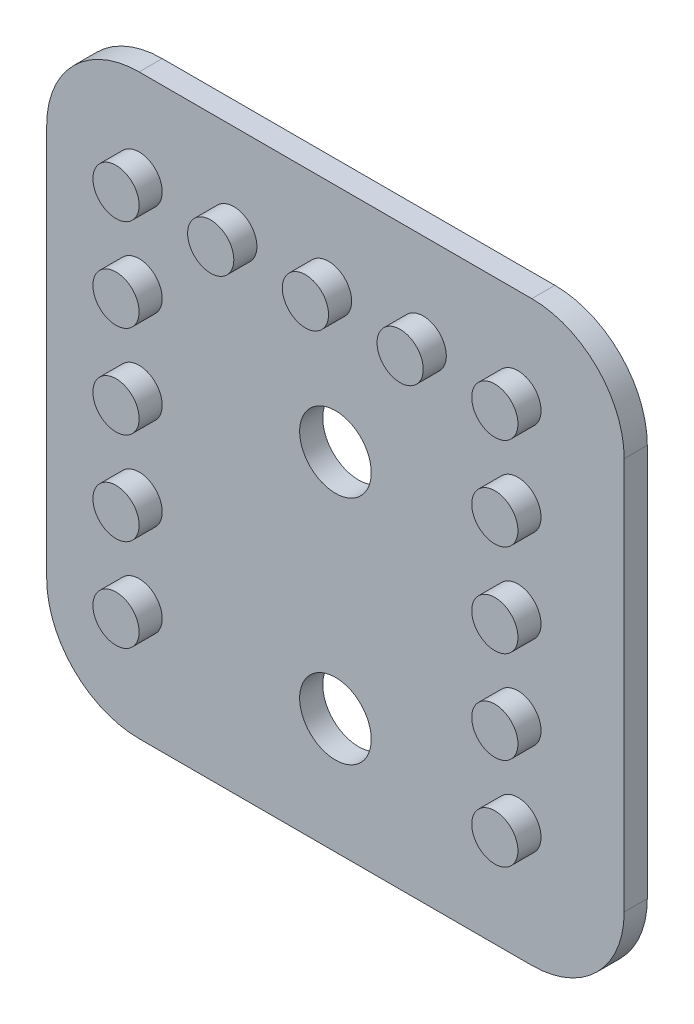
ISO-10303-21;
HEADER;
FILE_DESCRIPTION(('STEP AP214'),'2;1');
FILE_NAME('part.step','',(''),(''),'','','');
FILE_SCHEMA(('AUTOMOTIVE_DESIGN { 1 0 10303 214 1 1 1 1 }'));
ENDSEC;
DATA;
#1=APPLICATION_CONTEXT('core data for automotive mechanical design processes');
#2=APPLICATION_PROTOCOL_DEFINITION('international standard','automotive_design',2000,#1);
#3=PRODUCT_CONTEXT('',#1,'mechanical');
#4=PRODUCT('Part','Part','',(#3));
#5=PRODUCT_RELATED_PRODUCT_CATEGORY('part','',(#4));
#6=PRODUCT_DEFINITION_FORMATION('','',#4);
#7=PRODUCT_DEFINITION_CONTEXT('part definition',#1,'design');
#8=PRODUCT_DEFINITION('design','',#6,#7);
#9=PRODUCT_DEFINITION_SHAPE('','',#8);
#10=(LENGTH_UNIT() NAMED_UNIT(*) SI_UNIT(.MILLI.,.METRE.));
#11=(NAMED_UNIT(*) PLANE_ANGLE_UNIT() SI_UNIT($,.RADIAN.));
#12=(NAMED_UNIT(*) SI_UNIT($,.STERADIAN.) SOLID_ANGLE_UNIT());
#13=UNCERTAINTY_MEASURE_WITH_UNIT(LENGTH_MEASURE(1.E-05),#10,'distance_accuracy_value','');
#14=(GEOMETRIC_REPRESENTATION_CONTEXT(3) GLOBAL_UNCERTAINTY_ASSIGNED_CONTEXT((#13)) GLOBAL_UNIT_ASSIGNED_CONTEXT((#10,
#11,#12)) REPRESENTATION_CONTEXT('',''));
#15=CARTESIAN_POINT('',(0.,0.,0.));
#16=DIRECTION('',(0.,0.,1.));
#17=DIRECTION('',(1.,0.,0.));
#18=AXIS2_PLACEMENT_3D('',#15,#16,#17);
#19=CARTESIAN_POINT('',(0.,0.,1.));
#20=DIRECTION('',(0.,0.,1.));
#21=DIRECTION('',(1.,0.,0.));
#22=AXIS2_PLACEMENT_3D('',#19,#20,#21);
#23=PLANE('',#22);
#24=CARTESIAN_POINT('',(-23.5,13.,1.));
#25=DIRECTION('',(0.,0.,1.));
#26=DIRECTION('',(1.,0.,0.));
#27=AXIS2_PLACEMENT_3D('',#24,#25,#26);
#28=CIRCLE('',#27,1.55);
#29=CARTESIAN_POINT('',(-21.95,13.,1.));
#30=VERTEX_POINT('',#29);
#31=EDGE_CURVE('E256',#30,#30,#28,.T.);
#32=ORIENTED_EDGE('',*,*,#31,.F.);
#33=EDGE_LOOP('',(#32));
#34=FACE_BOUND('',#33,.T.);
#35=CARTESIAN_POINT('',(-23.5,23.,1.));
#36=DIRECTION('',(0.,0.,1.));
#37=DIRECTION('',(1.,0.,0.));
#38=AXIS2_PLACEMENT_3D('',#35,#36,#37);
#39=CIRCLE('',#38,1.55);
#40=CARTESIAN_POINT('',(-21.95,23.,1.));
#41=VERTEX_POINT('',#40);
#42=EDGE_CURVE('E250',#41,#41,#39,.T.);
#43=ORIENTED_EDGE('',*,*,#42,.F.);
#44=EDGE_LOOP('',(#43));
#45=FACE_BOUND('',#44,.T.);
#46=CARTESIAN_POINT('',(-31.9999999999998,13.,1.));
#47=DIRECTION('',(0.,0.,1.));
#48=DIRECTION('',(1.,0.,0.));
#49=AXIS2_PLACEMENT_3D('',#46,#47,#48);
#50=CIRCLE('',#49,0.999999999999998);
#51=CARTESIAN_POINT('',(-30.9999999999998,13.,1.));
#52=VERTEX_POINT('',#51);
#53=EDGE_CURVE('E236',#52,#52,#50,.T.);
#54=ORIENTED_EDGE('',*,*,#53,.F.);
#55=EDGE_LOOP('',(#54));
#56=FACE_BOUND('',#55,.T.);
#57=CARTESIAN_POINT('',(-31.9999999999999,17.,1.));
#58=DIRECTION('',(0.,0.,1.));
#59=DIRECTION('',(1.,0.,0.));
#60=AXIS2_PLACEMENT_3D('',#57,#58,#59);
#61=CIRCLE('',#60,0.999999999999998);
#62=CARTESIAN_POINT('',(-30.9999999999999,17.,1.));
#63=VERTEX_POINT('',#62);
#64=EDGE_CURVE('E224',#63,#63,#61,.T.);
#65=ORIENTED_EDGE('',*,*,#64,.F.);
#66=EDGE_LOOP('',(#65));
#67=FACE_BOUND('',#66,.T.);
#68=CARTESIAN_POINT('',(-31.9999999999999,21.,1.));
#69=DIRECTION('',(0.,0.,1.));
#70=DIRECTION('',(1.,0.,0.));
#71=AXIS2_PLACEMENT_3D('',#68,#69,#70);
#72=CIRCLE('',#71,0.999999999999998);
#73=CARTESIAN_POINT('',(-30.9999999999999,21.,1.));
#74=VERTEX_POINT('',#73);
#75=EDGE_CURVE('E212',#74,#74,#72,.T.);
#76=ORIENTED_EDGE('',*,*,#75,.F.);
#77=EDGE_LOOP('',(#76));
#78=FACE_BOUND('',#77,.T.);
#79=CARTESIAN_POINT('',(-32.,25.,1.));
#80=DIRECTION('',(0.,0.,1.));
#81=DIRECTION('',(1.,0.,0.));
#82=AXIS2_PLACEMENT_3D('',#79,#80,#81);
#83=CIRCLE('',#82,0.999999999999998);
#84=CARTESIAN_POINT('',(-31.,25.,1.));
#85=VERTEX_POINT('',#84);
#86=EDGE_CURVE('E200',#85,#85,#83,.T.);
#87=ORIENTED_EDGE('',*,*,#86,.F.);
#88=EDGE_LOOP('',(#87));
#89=FACE_BOUND('',#88,.T.);
#90=CARTESIAN_POINT('',(-19.7,29.,1.));
#91=DIRECTION('',(0.,0.,1.));
#92=DIRECTION('',(1.,0.,0.));
#93=AXIS2_PLACEMENT_3D('',#90,#91,#92);
#94=CIRCLE('',#93,0.999999999999998);
#95=CARTESIAN_POINT('',(-18.7,29.,1.));
#96=VERTEX_POINT('',#95);
#97=EDGE_CURVE('E188',#96,#96,#94,.T.);
#98=ORIENTED_EDGE('',*,*,#97,.F.);
#99=EDGE_LOOP('',(#98));
#100=FACE_BOUND('',#99,.T.);
#101=CARTESIAN_POINT('',(-27.9,29.,1.));
#102=DIRECTION('',(0.,0.,1.));
#103=DIRECTION('',(1.,0.,0.));
#104=AXIS2_PLACEMENT_3D('',#101,#102,#103);
#105=CIRCLE('',#104,0.999999999999998);
#106=CARTESIAN_POINT('',(-26.9,29.,1.));
#107=VERTEX_POINT('',#106);
#108=EDGE_CURVE('E176',#107,#107,#105,.T.);
#109=ORIENTED_EDGE('',*,*,#108,.F.);
#110=EDGE_LOOP('',(#109));
#111=FACE_BOUND('',#110,.T.);
#112=DIRECTION('',(0.,-1.,0.));
#113=VECTOR('',#112,1.);
#114=CARTESIAN_POINT('',(-36.,8.,1.));
#115=LINE('',#114,#113);
#116=CARTESIAN_POINT('',(-36.,29.,1.));
#117=VERTEX_POINT('',#116);
#118=CARTESIAN_POINT('',(-36.,12.,1.));
#119=VERTEX_POINT('',#118);
#120=EDGE_CURVE('E169',#117,#119,#115,.T.);
#121=ORIENTED_EDGE('',*,*,#120,.T.);
#122=CARTESIAN_POINT('',(-32.,12.,1.));
#123=DIRECTION('',(0.,0.,1.));
#124=DIRECTION('',(1.,0.,0.));
#125=AXIS2_PLACEMENT_3D('',#122,#123,#124);
#126=CIRCLE('',#125,4.);
#127=CARTESIAN_POINT('',(-32.,8.,1.));
#128=VERTEX_POINT('',#127);
#129=EDGE_CURVE('E146',#119,#128,#126,.T.);
#130=ORIENTED_EDGE('',*,*,#129,.T.);
#131=DIRECTION('',(1.,0.,0.));
#132=VECTOR('',#131,1.);
#133=CARTESIAN_POINT('',(-11.,8.00000000000001,1.));
#134=LINE('',#133,#132);
#135=CARTESIAN_POINT('',(-15.,8.00000000000001,1.));
#136=VERTEX_POINT('',#135);
#137=EDGE_CURVE('E118',#128,#136,#134,.T.);
#138=ORIENTED_EDGE('',*,*,#137,.T.);
#139=CARTESIAN_POINT('',(-15.,12.,1.));
#140=DIRECTION('',(0.,0.,1.));
#141=DIRECTION('',(1.,0.,0.));
#142=AXIS2_PLACEMENT_3D('',#139,#140,#141);
#143=CIRCLE('',#142,4.);
#144=CARTESIAN_POINT('',(-11.,12.,1.));
#145=VERTEX_POINT('',#144);
#146=EDGE_CURVE('E144',#136,#145,#143,.T.);
#147=ORIENTED_EDGE('',*,*,#146,.T.);
#148=DIRECTION('',(0.,1.,0.));
#149=VECTOR('',#148,1.);
#150=CARTESIAN_POINT('',(-11.,8.00000000000001,1.));
#151=LINE('',#150,#149);
#152=CARTESIAN_POINT('',(-11.,29.,1.));
#153=VERTEX_POINT('',#152);
#154=EDGE_CURVE('E124',#145,#153,#151,.T.);
#155=ORIENTED_EDGE('',*,*,#154,.T.);
#156=CARTESIAN_POINT('',(-15.,29.,1.));
#157=DIRECTION('',(0.,0.,1.));
#158=DIRECTION('',(1.,0.,0.));
#159=AXIS2_PLACEMENT_3D('',#156,#157,#158);
#160=CIRCLE('',#159,4.);
#161=CARTESIAN_POINT('',(-15.,33.,1.));
#162=VERTEX_POINT('',#161);
#163=EDGE_CURVE('E53',#153,#162,#160,.T.);
#164=ORIENTED_EDGE('',*,*,#163,.T.);
#165=DIRECTION('',(-1.,0.,0.));
#166=VECTOR('',#165,1.);
#167=CARTESIAN_POINT('',(-11.,33.,1.));
#168=LINE('',#167,#166);
#169=CARTESIAN_POINT('',(-32.,33.,1.));
#170=VERTEX_POINT('',#169);
#171=EDGE_CURVE('E127',#162,#170,#168,.T.);
#172=ORIENTED_EDGE('',*,*,#171,.T.);
#173=CARTESIAN_POINT('',(-32.,29.,1.));
#174=DIRECTION('',(0.,0.,1.));
#175=DIRECTION('',(1.,0.,0.));
#176=AXIS2_PLACEMENT_3D('',#173,#174,#175);
#177=CIRCLE('',#176,4.);
#178=EDGE_CURVE('E141',#170,#117,#177,.T.);
#179=ORIENTED_EDGE('',*,*,#178,.T.);
#180=EDGE_LOOP('',(#121,#130,#138,#147,#155,#164,#172,#179));
#181=FACE_BOUND('',#180,.T.);
#182=CARTESIAN_POINT('',(-32.,29.,1.));
#183=DIRECTION('',(0.,0.,1.));
#184=DIRECTION('',(1.,0.,0.));
#185=AXIS2_PLACEMENT_3D('',#182,#183,#184);
#186=CIRCLE('',#185,0.999999999999998);
#187=CARTESIAN_POINT('',(-31.,29.,1.));
#188=VERTEX_POINT('',#187);
#189=EDGE_CURVE('E165',#188,#188,#186,.T.);
#190=ORIENTED_EDGE('',*,*,#189,.F.);
#191=EDGE_LOOP('',(#190));
#192=FACE_BOUND('',#191,.T.);
#193=CARTESIAN_POINT('',(-23.8,29.,1.));
#194=DIRECTION('',(0.,0.,1.));
#195=DIRECTION('',(1.,0.,0.));
#196=AXIS2_PLACEMENT_3D('',#193,#194,#195);
#197=CIRCLE('',#196,0.999999999999998);
#198=CARTESIAN_POINT('',(-22.8,29.,1.));
#199=VERTEX_POINT('',#198);
#200=EDGE_CURVE('E182',#199,#199,#197,.T.);
#201=ORIENTED_EDGE('',*,*,#200,.F.);
#202=EDGE_LOOP('',(#201));
#203=FACE_BOUND('',#202,.T.);
#204=CARTESIAN_POINT('',(-15.6,29.,1.));
#205=DIRECTION('',(0.,0.,1.));
#206=DIRECTION('',(1.,0.,0.));
#207=AXIS2_PLACEMENT_3D('',#204,#205,#206);
#208=CIRCLE('',#207,0.999999999999998);
#209=CARTESIAN_POINT('',(-14.6,29.,1.));
#210=VERTEX_POINT('',#209);
#211=EDGE_CURVE('E194',#210,#210,#208,.T.);
#212=ORIENTED_EDGE('',*,*,#211,.F.);
#213=EDGE_LOOP('',(#212));
#214=FACE_BOUND('',#213,.T.);
#215=CARTESIAN_POINT('',(-15.6,25.,1.));
#216=DIRECTION('',(0.,0.,1.));
#217=DIRECTION('',(1.,0.,0.));
#218=AXIS2_PLACEMENT_3D('',#215,#216,#217);
#219=CIRCLE('',#218,0.999999999999998);
#220=CARTESIAN_POINT('',(-14.6,25.,1.));
#221=VERTEX_POINT('',#220);
#222=EDGE_CURVE('E206',#221,#221,#219,.T.);
#223=ORIENTED_EDGE('',*,*,#222,.F.);
#224=EDGE_LOOP('',(#223));
#225=FACE_BOUND('',#224,.T.);
#226=CARTESIAN_POINT('',(-15.5999999999999,21.,1.));
#227=DIRECTION('',(0.,0.,1.));
#228=DIRECTION('',(1.,0.,0.));
#229=AXIS2_PLACEMENT_3D('',#226,#227,#228);
#230=CIRCLE('',#229,0.999999999999998);
#231=CARTESIAN_POINT('',(-14.5999999999999,21.,1.));
#232=VERTEX_POINT('',#231);
#233=EDGE_CURVE('E218',#232,#232,#230,.T.);
#234=ORIENTED_EDGE('',*,*,#233,.F.);
#235=EDGE_LOOP('',(#234));
#236=FACE_BOUND('',#235,.T.);
#237=CARTESIAN_POINT('',(-15.5999999999999,17.,1.));
#238=DIRECTION('',(0.,0.,1.));
#239=DIRECTION('',(1.,0.,0.));
#240=AXIS2_PLACEMENT_3D('',#237,#238,#239);
#241=CIRCLE('',#240,0.999999999999998);
#242=CARTESIAN_POINT('',(-14.5999999999999,17.,1.));
#243=VERTEX_POINT('',#242);
#244=EDGE_CURVE('E230',#243,#243,#241,.T.);
#245=ORIENTED_EDGE('',*,*,#244,.F.);
#246=EDGE_LOOP('',(#245));
#247=FACE_BOUND('',#246,.T.);
#248=CARTESIAN_POINT('',(-15.5999999999998,13.,1.));
#249=DIRECTION('',(0.,0.,1.));
#250=DIRECTION('',(1.,0.,0.));
#251=AXIS2_PLACEMENT_3D('',#248,#249,#250);
#252=CIRCLE('',#251,0.999999999999998);
#253=CARTESIAN_POINT('',(-14.5999999999998,13.,1.));
#254=VERTEX_POINT('',#253);
#255=EDGE_CURVE('E242',#254,#254,#252,.T.);
#256=ORIENTED_EDGE('',*,*,#255,.F.);
#257=EDGE_LOOP('',(#256));
#258=FACE_BOUND('',#257,.T.);
#259=ADVANCED_FACE('F32',(#34,#45,#56,#67,#78,#89,#100,#111,#181,#192,#203,#214,#225,#236,#247,
#258),#23,.T.);
#260=CARTESIAN_POINT('',(-11.,8.00000000000001,1.));
#261=DIRECTION('',(-1.,0.,0.));
#262=DIRECTION('',(0.,0.,1.));
#263=AXIS2_PLACEMENT_3D('',#260,#261,#262);
#264=PLANE('',#263);
#265=ORIENTED_EDGE('',*,*,#154,.F.);
#266=DIRECTION('',(0.,0.,-1.));
#267=VECTOR('',#266,1.);
#268=CARTESIAN_POINT('',(-11.,12.,1.));
#269=LINE('',#268,#267);
#270=CARTESIAN_POINT('',(-11.,12.,0.));
#271=VERTEX_POINT('',#270);
#272=EDGE_CURVE('E150',#145,#271,#269,.T.);
#273=ORIENTED_EDGE('',*,*,#272,.T.);
#274=DIRECTION('',(0.,1.,0.));
#275=VECTOR('',#274,1.);
#276=CARTESIAN_POINT('',(-11.,8.00000000000001,0.));
#277=LINE('',#276,#275);
#278=CARTESIAN_POINT('',(-11.,29.,0.));
#279=VERTEX_POINT('',#278);
#280=EDGE_CURVE('E157',#271,#279,#277,.T.);
#281=ORIENTED_EDGE('',*,*,#280,.T.);
#282=DIRECTION('',(0.,0.,-1.));
#283=VECTOR('',#282,1.);
#284=CARTESIAN_POINT('',(-11.,29.,1.));
#285=LINE('',#284,#283);
#286=EDGE_CURVE('E148',#279,#153,#285,.F.);
#287=ORIENTED_EDGE('',*,*,#286,.T.);
#288=EDGE_LOOP('',(#265,#273,#281,#287));
#289=FACE_BOUND('',#288,.T.);
#290=ADVANCED_FACE('F156',(#289),#264,.F.);
#291=CARTESIAN_POINT('',(-11.,33.,1.));
#292=DIRECTION('',(0.,-1.,0.));
#293=DIRECTION('',(0.,0.,-1.));
#294=AXIS2_PLACEMENT_3D('',#291,#292,#293);
#295=PLANE('',#294);
#296=ORIENTED_EDGE('',*,*,#171,.F.);
#297=DIRECTION('',(0.,0.,-1.));
#298=VECTOR('',#297,1.);
#299=CARTESIAN_POINT('',(-15.,33.,1.));
#300=LINE('',#299,#298);
#301=CARTESIAN_POINT('',(-15.,33.,0.));
#302=VERTEX_POINT('',#301);
#303=EDGE_CURVE('E11',#162,#302,#300,.T.);
#304=ORIENTED_EDGE('',*,*,#303,.T.);
#305=DIRECTION('',(-1.,0.,0.));
#306=VECTOR('',#305,1.);
#307=CARTESIAN_POINT('',(-11.,33.,0.));
#308=LINE('',#307,#306);
#309=CARTESIAN_POINT('',(-32.,33.,0.));
#310=VERTEX_POINT('',#309);
#311=EDGE_CURVE('E129',#302,#310,#308,.T.);
#312=ORIENTED_EDGE('',*,*,#311,.T.);
#313=DIRECTION('',(0.,0.,-1.));
#314=VECTOR('',#313,1.);
#315=CARTESIAN_POINT('',(-32.,33.,1.));
#316=LINE('',#315,#314);
#317=EDGE_CURVE('E40',#310,#170,#316,.F.);
#318=ORIENTED_EDGE('',*,*,#317,.T.);
#319=EDGE_LOOP('',(#296,#304,#312,#318));
#320=FACE_BOUND('',#319,.T.);
#321=ADVANCED_FACE('F412',(#320),#295,.F.);
#322=CARTESIAN_POINT('',(-36.,8.,1.));
#323=DIRECTION('',(1.,0.,0.));
#324=DIRECTION('',(0.,0.,-1.));
#325=AXIS2_PLACEMENT_3D('',#322,#323,#324);
#326=PLANE('',#325);
#327=DIRECTION('',(0.,-1.,0.));
#328=VECTOR('',#327,1.);
#329=CARTESIAN_POINT('',(-36.,8.,0.));
#330=LINE('',#329,#328);
#331=CARTESIAN_POINT('',(-36.,29.,0.));
#332=VERTEX_POINT('',#331);
#333=CARTESIAN_POINT('',(-36.,12.,0.));
#334=VERTEX_POINT('',#333);
#335=EDGE_CURVE('E125',#332,#334,#330,.T.);
#336=ORIENTED_EDGE('',*,*,#335,.T.);
#337=DIRECTION('',(0.,0.,-1.));
#338=VECTOR('',#337,1.);
#339=CARTESIAN_POINT('',(-36.,12.,1.));
#340=LINE('',#339,#338);
#341=EDGE_CURVE('E103',#334,#119,#340,.F.);
#342=ORIENTED_EDGE('',*,*,#341,.T.);
#343=ORIENTED_EDGE('',*,*,#120,.F.);
#344=DIRECTION('',(0.,0.,-1.));
#345=VECTOR('',#344,1.);
#346=CARTESIAN_POINT('',(-36.,29.,1.));
#347=LINE('',#346,#345);
#348=EDGE_CURVE('E108',#117,#332,#347,.T.);
#349=ORIENTED_EDGE('',*,*,#348,.T.);
#350=EDGE_LOOP('',(#336,#342,#343,#349));
#351=FACE_BOUND('',#350,.T.);
#352=ADVANCED_FACE('F409',(#351),#326,.F.);
#353=CARTESIAN_POINT('',(-11.,8.00000000000001,1.));
#354=DIRECTION('',(0.,1.,0.));
#355=DIRECTION('',(-1.,0.,0.));
#356=AXIS2_PLACEMENT_3D('',#353,#354,#355);
#357=PLANE('',#356);
#358=ORIENTED_EDGE('',*,*,#137,.F.);
#359=DIRECTION('',(0.,0.,-1.));
#360=VECTOR('',#359,1.);
#361=CARTESIAN_POINT('',(-32.,8.,1.));
#362=LINE('',#361,#360);
#363=CARTESIAN_POINT('',(-32.,8.,0.));
#364=VERTEX_POINT('',#363);
#365=EDGE_CURVE('E102',#128,#364,#362,.T.);
#366=ORIENTED_EDGE('',*,*,#365,.T.);
#367=DIRECTION('',(1.,0.,0.));
#368=VECTOR('',#367,1.);
#369=CARTESIAN_POINT('',(-11.,8.00000000000001,0.));
#370=LINE('',#369,#368);
#371=CARTESIAN_POINT('',(-15.,8.00000000000001,0.));
#372=VERTEX_POINT('',#371);
#373=EDGE_CURVE('E115',#364,#372,#370,.T.);
#374=ORIENTED_EDGE('',*,*,#373,.T.);
#375=DIRECTION('',(0.,0.,-1.));
#376=VECTOR('',#375,1.);
#377=CARTESIAN_POINT('',(-15.,8.00000000000001,1.));
#378=LINE('',#377,#376);
#379=EDGE_CURVE('E120',#372,#136,#378,.F.);
#380=ORIENTED_EDGE('',*,*,#379,.T.);
#381=EDGE_LOOP('',(#358,#366,#374,#380));
#382=FACE_BOUND('',#381,.T.);
#383=ADVANCED_FACE('F114',(#382),#357,.F.);
#384=CARTESIAN_POINT('',(0.,0.,0.));
#385=DIRECTION('',(0.,0.,1.));
#386=DIRECTION('',(1.,0.,0.));
#387=AXIS2_PLACEMENT_3D('',#384,#385,#386);
#388=PLANE('',#387);
#389=CARTESIAN_POINT('',(-23.5,13.,0.));
#390=DIRECTION('',(0.,0.,1.));
#391=DIRECTION('',(1.,0.,0.));
#392=AXIS2_PLACEMENT_3D('',#389,#390,#391);
#393=CIRCLE('',#392,1.55);
#394=CARTESIAN_POINT('',(-21.95,13.,0.));
#395=VERTEX_POINT('',#394);
#396=EDGE_CURVE('E253',#395,#395,#393,.F.);
#397=ORIENTED_EDGE('',*,*,#396,.F.);
#398=EDGE_LOOP('',(#397));
#399=FACE_BOUND('',#398,.T.);
#400=CARTESIAN_POINT('',(-23.5,23.,0.));
#401=DIRECTION('',(0.,0.,1.));
#402=DIRECTION('',(1.,0.,0.));
#403=AXIS2_PLACEMENT_3D('',#400,#401,#402);
#404=CIRCLE('',#403,1.55);
#405=CARTESIAN_POINT('',(-21.95,23.,0.));
#406=VERTEX_POINT('',#405);
#407=EDGE_CURVE('E245',#406,#406,#404,.F.);
#408=ORIENTED_EDGE('',*,*,#407,.F.);
#409=EDGE_LOOP('',(#408));
#410=FACE_BOUND('',#409,.T.);
#411=ORIENTED_EDGE('',*,*,#373,.F.);
#412=CARTESIAN_POINT('',(-32.,12.,0.));
#413=DIRECTION('',(0.,0.,1.));
#414=DIRECTION('',(1.,0.,0.));
#415=AXIS2_PLACEMENT_3D('',#412,#413,#414);
#416=CIRCLE('',#415,4.);
#417=EDGE_CURVE('E98',#364,#334,#416,.F.);
#418=ORIENTED_EDGE('',*,*,#417,.T.);
#419=ORIENTED_EDGE('',*,*,#335,.F.);
#420=CARTESIAN_POINT('',(-32.,29.,0.));
#421=DIRECTION('',(0.,0.,1.));
#422=DIRECTION('',(1.,0.,0.));
#423=AXIS2_PLACEMENT_3D('',#420,#421,#422);
#424=CIRCLE('',#423,4.);
#425=EDGE_CURVE('E119',#332,#310,#424,.F.);
#426=ORIENTED_EDGE('',*,*,#425,.T.);
#427=ORIENTED_EDGE('',*,*,#311,.F.);
#428=CARTESIAN_POINT('',(-15.,29.,0.));
#429=DIRECTION('',(0.,0.,1.));
#430=DIRECTION('',(1.,0.,0.));
#431=AXIS2_PLACEMENT_3D('',#428,#429,#430);
#432=CIRCLE('',#431,4.);
#433=EDGE_CURVE('E135',#302,#279,#432,.F.);
#434=ORIENTED_EDGE('',*,*,#433,.T.);
#435=ORIENTED_EDGE('',*,*,#280,.F.);
#436=CARTESIAN_POINT('',(-15.,12.,0.));
#437=DIRECTION('',(0.,0.,1.));
#438=DIRECTION('',(1.,0.,0.));
#439=AXIS2_PLACEMENT_3D('',#436,#437,#438);
#440=CIRCLE('',#439,4.);
#441=EDGE_CURVE('E109',#271,#372,#440,.F.);
#442=ORIENTED_EDGE('',*,*,#441,.T.);
#443=EDGE_LOOP('',(#411,#418,#419,#426,#427,#434,#435,#442));
#444=FACE_BOUND('',#443,.T.);
#445=ADVANCED_FACE('F122',(#399,#410,#444),#388,.F.);
#446=CARTESIAN_POINT('',(-32.,29.,2.));
#447=DIRECTION('',(0.,0.,-1.));
#448=DIRECTION('',(-1.,0.,0.));
#449=AXIS2_PLACEMENT_3D('',#446,#447,#448);
#450=CYLINDRICAL_SURFACE('',#449,0.999999999999998);
#451=CARTESIAN_POINT('',(-32.,29.,2.));
#452=DIRECTION('',(0.,0.,1.));
#453=DIRECTION('',(1.,0.,0.));
#454=AXIS2_PLACEMENT_3D('',#451,#452,#453);
#455=CIRCLE('',#454,0.999999999999998);
#456=CARTESIAN_POINT('',(-31.,29.,2.));
#457=VERTEX_POINT('',#456);
#458=EDGE_CURVE('E162',#457,#457,#455,.T.);
#459=ORIENTED_EDGE('',*,*,#458,.F.);
#460=EDGE_LOOP('',(#459));
#461=FACE_BOUND('',#460,.T.);
#462=ORIENTED_EDGE('',*,*,#189,.T.);
#463=EDGE_LOOP('',(#462));
#464=FACE_BOUND('',#463,.T.);
#465=ADVANCED_FACE('F399',(#461,#464),#450,.T.);
#466=CARTESIAN_POINT('',(-32.,29.,2.));
#467=DIRECTION('',(0.,0.,1.));
#468=DIRECTION('',(1.,0.,0.));
#469=AXIS2_PLACEMENT_3D('',#466,#467,#468);
#470=PLANE('',#469);
#471=ORIENTED_EDGE('',*,*,#458,.T.);
#472=EDGE_LOOP('',(#471));
#473=FACE_BOUND('',#472,.T.);
#474=ADVANCED_FACE('F395',(#473),#470,.T.);
#475=CARTESIAN_POINT('',(-27.9,29.,2.));
#476=DIRECTION('',(0.,0.,-1.));
#477=DIRECTION('',(-1.,0.,0.));
#478=AXIS2_PLACEMENT_3D('',#475,#476,#477);
#479=CYLINDRICAL_SURFACE('',#478,0.999999999999998);
#480=CARTESIAN_POINT('',(-27.9,29.,2.));
#481=DIRECTION('',(0.,0.,1.));
#482=DIRECTION('',(1.,0.,0.));
#483=AXIS2_PLACEMENT_3D('',#480,#481,#482);
#484=CIRCLE('',#483,0.999999999999998);
#485=CARTESIAN_POINT('',(-26.9,29.,2.));
#486=VERTEX_POINT('',#485);
#487=EDGE_CURVE('E174',#486,#486,#484,.T.);
#488=ORIENTED_EDGE('',*,*,#487,.F.);
#489=EDGE_LOOP('',(#488));
#490=FACE_BOUND('',#489,.T.);
#491=ORIENTED_EDGE('',*,*,#108,.T.);
#492=EDGE_LOOP('',(#491));
#493=FACE_BOUND('',#492,.T.);
#494=ADVANCED_FACE('F391',(#490,#493),#479,.T.);
#495=CARTESIAN_POINT('',(-27.9,29.,2.));
#496=DIRECTION('',(0.,0.,1.));
#497=DIRECTION('',(1.,0.,0.));
#498=AXIS2_PLACEMENT_3D('',#495,#496,#497);
#499=PLANE('',#498);
#500=ORIENTED_EDGE('',*,*,#487,.T.);
#501=EDGE_LOOP('',(#500));
#502=FACE_BOUND('',#501,.T.);
#503=ADVANCED_FACE('F387',(#502),#499,.T.);
#504=CARTESIAN_POINT('',(-23.8,29.,2.));
#505=DIRECTION('',(0.,0.,-1.));
#506=DIRECTION('',(-1.,0.,0.));
#507=AXIS2_PLACEMENT_3D('',#504,#505,#506);
#508=CYLINDRICAL_SURFACE('',#507,0.999999999999998);
#509=CARTESIAN_POINT('',(-23.8,29.,2.));
#510=DIRECTION('',(0.,0.,1.));
#511=DIRECTION('',(1.,0.,0.));
#512=AXIS2_PLACEMENT_3D('',#509,#510,#511);
#513=CIRCLE('',#512,0.999999999999998);
#514=CARTESIAN_POINT('',(-22.8,29.,2.));
#515=VERTEX_POINT('',#514);
#516=EDGE_CURVE('E179',#515,#515,#513,.T.);
#517=ORIENTED_EDGE('',*,*,#516,.F.);
#518=EDGE_LOOP('',(#517));
#519=FACE_BOUND('',#518,.T.);
#520=ORIENTED_EDGE('',*,*,#200,.T.);
#521=EDGE_LOOP('',(#520));
#522=FACE_BOUND('',#521,.T.);
#523=ADVANCED_FACE('F383',(#519,#522),#508,.T.);
#524=CARTESIAN_POINT('',(-23.8,29.,2.));
#525=DIRECTION('',(0.,0.,1.));
#526=DIRECTION('',(1.,0.,0.));
#527=AXIS2_PLACEMENT_3D('',#524,#525,#526);
#528=PLANE('',#527);
#529=ORIENTED_EDGE('',*,*,#516,.T.);
#530=EDGE_LOOP('',(#529));
#531=FACE_BOUND('',#530,.T.);
#532=ADVANCED_FACE('F379',(#531),#528,.T.);
#533=CARTESIAN_POINT('',(-19.7,29.,2.));
#534=DIRECTION('',(0.,0.,-1.));
#535=DIRECTION('',(-1.,0.,0.));
#536=AXIS2_PLACEMENT_3D('',#533,#534,#535);
#537=CYLINDRICAL_SURFACE('',#536,0.999999999999998);
#538=CARTESIAN_POINT('',(-19.7,29.,2.));
#539=DIRECTION('',(0.,0.,1.));
#540=DIRECTION('',(1.,0.,0.));
#541=AXIS2_PLACEMENT_3D('',#538,#539,#540);
#542=CIRCLE('',#541,0.999999999999998);
#543=CARTESIAN_POINT('',(-18.7,29.,2.));
#544=VERTEX_POINT('',#543);
#545=EDGE_CURVE('E185',#544,#544,#542,.T.);
#546=ORIENTED_EDGE('',*,*,#545,.F.);
#547=EDGE_LOOP('',(#546));
#548=FACE_BOUND('',#547,.T.);
#549=ORIENTED_EDGE('',*,*,#97,.T.);
#550=EDGE_LOOP('',(#549));
#551=FACE_BOUND('',#550,.T.);
#552=ADVANCED_FACE('F375',(#548,#551),#537,.T.);
#553=CARTESIAN_POINT('',(-19.7,29.,2.));
#554=DIRECTION('',(0.,0.,1.));
#555=DIRECTION('',(1.,0.,0.));
#556=AXIS2_PLACEMENT_3D('',#553,#554,#555);
#557=PLANE('',#556);
#558=ORIENTED_EDGE('',*,*,#545,.T.);
#559=EDGE_LOOP('',(#558));
#560=FACE_BOUND('',#559,.T.);
#561=ADVANCED_FACE('F371',(#560),#557,.T.);
#562=CARTESIAN_POINT('',(-15.6,29.,2.));
#563=DIRECTION('',(0.,0.,-1.));
#564=DIRECTION('',(-1.,0.,0.));
#565=AXIS2_PLACEMENT_3D('',#562,#563,#564);
#566=CYLINDRICAL_SURFACE('',#565,0.999999999999998);
#567=CARTESIAN_POINT('',(-15.6,29.,2.));
#568=DIRECTION('',(0.,0.,1.));
#569=DIRECTION('',(1.,0.,0.));
#570=AXIS2_PLACEMENT_3D('',#567,#568,#569);
#571=CIRCLE('',#570,0.999999999999998);
#572=CARTESIAN_POINT('',(-14.6,29.,2.));
#573=VERTEX_POINT('',#572);
#574=EDGE_CURVE('E191',#573,#573,#571,.T.);
#575=ORIENTED_EDGE('',*,*,#574,.F.);
#576=EDGE_LOOP('',(#575));
#577=FACE_BOUND('',#576,.T.);
#578=ORIENTED_EDGE('',*,*,#211,.T.);
#579=EDGE_LOOP('',(#578));
#580=FACE_BOUND('',#579,.T.);
#581=ADVANCED_FACE('F367',(#577,#580),#566,.T.);
#582=CARTESIAN_POINT('',(-15.6,29.,2.));
#583=DIRECTION('',(0.,0.,1.));
#584=DIRECTION('',(1.,0.,0.));
#585=AXIS2_PLACEMENT_3D('',#582,#583,#584);
#586=PLANE('',#585);
#587=ORIENTED_EDGE('',*,*,#574,.T.);
#588=EDGE_LOOP('',(#587));
#589=FACE_BOUND('',#588,.T.);
#590=ADVANCED_FACE('F363',(#589),#586,.T.);
#591=CARTESIAN_POINT('',(-32.,25.,2.));
#592=DIRECTION('',(0.,0.,-1.));
#593=DIRECTION('',(-1.,0.,0.));
#594=AXIS2_PLACEMENT_3D('',#591,#592,#593);
#595=CYLINDRICAL_SURFACE('',#594,0.999999999999998);
#596=CARTESIAN_POINT('',(-32.,25.,2.));
#597=DIRECTION('',(0.,0.,1.));
#598=DIRECTION('',(1.,0.,0.));
#599=AXIS2_PLACEMENT_3D('',#596,#597,#598);
#600=CIRCLE('',#599,0.999999999999998);
#601=CARTESIAN_POINT('',(-31.,25.,2.));
#602=VERTEX_POINT('',#601);
#603=EDGE_CURVE('E197',#602,#602,#600,.T.);
#604=ORIENTED_EDGE('',*,*,#603,.F.);
#605=EDGE_LOOP('',(#604));
#606=FACE_BOUND('',#605,.T.);
#607=ORIENTED_EDGE('',*,*,#86,.T.);
#608=EDGE_LOOP('',(#607));
#609=FACE_BOUND('',#608,.T.);
#610=ADVANCED_FACE('F359',(#606,#609),#595,.T.);
#611=CARTESIAN_POINT('',(-32.,25.,2.));
#612=DIRECTION('',(0.,0.,1.));
#613=DIRECTION('',(1.,0.,0.));
#614=AXIS2_PLACEMENT_3D('',#611,#612,#613);
#615=PLANE('',#614);
#616=ORIENTED_EDGE('',*,*,#603,.T.);
#617=EDGE_LOOP('',(#616));
#618=FACE_BOUND('',#617,.T.);
#619=ADVANCED_FACE('F355',(#618),#615,.T.);
#620=CARTESIAN_POINT('',(-15.6,25.,2.));
#621=DIRECTION('',(0.,0.,-1.));
#622=DIRECTION('',(-1.,0.,0.));
#623=AXIS2_PLACEMENT_3D('',#620,#621,#622);
#624=CYLINDRICAL_SURFACE('',#623,0.999999999999998);
#625=CARTESIAN_POINT('',(-15.6,25.,2.));
#626=DIRECTION('',(0.,0.,1.));
#627=DIRECTION('',(1.,0.,0.));
#628=AXIS2_PLACEMENT_3D('',#625,#626,#627);
#629=CIRCLE('',#628,0.999999999999998);
#630=CARTESIAN_POINT('',(-14.6,25.,2.));
#631=VERTEX_POINT('',#630);
#632=EDGE_CURVE('E203',#631,#631,#629,.T.);
#633=ORIENTED_EDGE('',*,*,#632,.F.);
#634=EDGE_LOOP('',(#633));
#635=FACE_BOUND('',#634,.T.);
#636=ORIENTED_EDGE('',*,*,#222,.T.);
#637=EDGE_LOOP('',(#636));
#638=FACE_BOUND('',#637,.T.);
#639=ADVANCED_FACE('F351',(#635,#638),#624,.T.);
#640=CARTESIAN_POINT('',(-15.6,25.,2.));
#641=DIRECTION('',(0.,0.,1.));
#642=DIRECTION('',(1.,0.,0.));
#643=AXIS2_PLACEMENT_3D('',#640,#641,#642);
#644=PLANE('',#643);
#645=ORIENTED_EDGE('',*,*,#632,.T.);
#646=EDGE_LOOP('',(#645));
#647=FACE_BOUND('',#646,.T.);
#648=ADVANCED_FACE('F347',(#647),#644,.T.);
#649=CARTESIAN_POINT('',(-31.9999999999999,21.,2.));
#650=DIRECTION('',(0.,0.,-1.));
#651=DIRECTION('',(-1.,0.,0.));
#652=AXIS2_PLACEMENT_3D('',#649,#650,#651);
#653=CYLINDRICAL_SURFACE('',#652,0.999999999999998);
#654=CARTESIAN_POINT('',(-31.9999999999999,21.,2.));
#655=DIRECTION('',(0.,0.,1.));
#656=DIRECTION('',(1.,0.,0.));
#657=AXIS2_PLACEMENT_3D('',#654,#655,#656);
#658=CIRCLE('',#657,0.999999999999998);
#659=CARTESIAN_POINT('',(-30.9999999999999,21.,2.));
#660=VERTEX_POINT('',#659);
#661=EDGE_CURVE('E209',#660,#660,#658,.T.);
#662=ORIENTED_EDGE('',*,*,#661,.F.);
#663=EDGE_LOOP('',(#662));
#664=FACE_BOUND('',#663,.T.);
#665=ORIENTED_EDGE('',*,*,#75,.T.);
#666=EDGE_LOOP('',(#665));
#667=FACE_BOUND('',#666,.T.);
#668=ADVANCED_FACE('F343',(#664,#667),#653,.T.);
#669=CARTESIAN_POINT('',(-31.9999999999999,21.,2.));
#670=DIRECTION('',(0.,0.,1.));
#671=DIRECTION('',(1.,0.,0.));
#672=AXIS2_PLACEMENT_3D('',#669,#670,#671);
#673=PLANE('',#672);
#674=ORIENTED_EDGE('',*,*,#661,.T.);
#675=EDGE_LOOP('',(#674));
#676=FACE_BOUND('',#675,.T.);
#677=ADVANCED_FACE('F339',(#676),#673,.T.);
#678=CARTESIAN_POINT('',(-15.5999999999999,21.,2.));
#679=DIRECTION('',(0.,0.,-1.));
#680=DIRECTION('',(-1.,0.,0.));
#681=AXIS2_PLACEMENT_3D('',#678,#679,#680);
#682=CYLINDRICAL_SURFACE('',#681,0.999999999999998);
#683=CARTESIAN_POINT('',(-15.5999999999999,21.,2.));
#684=DIRECTION('',(0.,0.,1.));
#685=DIRECTION('',(1.,0.,0.));
#686=AXIS2_PLACEMENT_3D('',#683,#684,#685);
#687=CIRCLE('',#686,0.999999999999998);
#688=CARTESIAN_POINT('',(-14.5999999999999,21.,2.));
#689=VERTEX_POINT('',#688);
#690=EDGE_CURVE('E215',#689,#689,#687,.T.);
#691=ORIENTED_EDGE('',*,*,#690,.F.);
#692=EDGE_LOOP('',(#691));
#693=FACE_BOUND('',#692,.T.);
#694=ORIENTED_EDGE('',*,*,#233,.T.);
#695=EDGE_LOOP('',(#694));
#696=FACE_BOUND('',#695,.T.);
#697=ADVANCED_FACE('F335',(#693,#696),#682,.T.);
#698=CARTESIAN_POINT('',(-15.5999999999999,21.,2.));
#699=DIRECTION('',(0.,0.,1.));
#700=DIRECTION('',(1.,0.,0.));
#701=AXIS2_PLACEMENT_3D('',#698,#699,#700);
#702=PLANE('',#701);
#703=ORIENTED_EDGE('',*,*,#690,.T.);
#704=EDGE_LOOP('',(#703));
#705=FACE_BOUND('',#704,.T.);
#706=ADVANCED_FACE('F331',(#705),#702,.T.);
#707=CARTESIAN_POINT('',(-31.9999999999999,17.,2.));
#708=DIRECTION('',(0.,0.,-1.));
#709=DIRECTION('',(-1.,0.,0.));
#710=AXIS2_PLACEMENT_3D('',#707,#708,#709);
#711=CYLINDRICAL_SURFACE('',#710,0.999999999999998);
#712=CARTESIAN_POINT('',(-31.9999999999999,17.,2.));
#713=DIRECTION('',(0.,0.,1.));
#714=DIRECTION('',(1.,0.,0.));
#715=AXIS2_PLACEMENT_3D('',#712,#713,#714);
#716=CIRCLE('',#715,0.999999999999998);
#717=CARTESIAN_POINT('',(-30.9999999999999,17.,2.));
#718=VERTEX_POINT('',#717);
#719=EDGE_CURVE('E221',#718,#718,#716,.T.);
#720=ORIENTED_EDGE('',*,*,#719,.F.);
#721=EDGE_LOOP('',(#720));
#722=FACE_BOUND('',#721,.T.);
#723=ORIENTED_EDGE('',*,*,#64,.T.);
#724=EDGE_LOOP('',(#723));
#725=FACE_BOUND('',#724,.T.);
#726=ADVANCED_FACE('F327',(#722,#725),#711,.T.);
#727=CARTESIAN_POINT('',(-31.9999999999999,17.,2.));
#728=DIRECTION('',(0.,0.,1.));
#729=DIRECTION('',(1.,0.,0.));
#730=AXIS2_PLACEMENT_3D('',#727,#728,#729);
#731=PLANE('',#730);
#732=ORIENTED_EDGE('',*,*,#719,.T.);
#733=EDGE_LOOP('',(#732));
#734=FACE_BOUND('',#733,.T.);
#735=ADVANCED_FACE('F323',(#734),#731,.T.);
#736=CARTESIAN_POINT('',(-15.5999999999999,17.,2.));
#737=DIRECTION('',(0.,0.,-1.));
#738=DIRECTION('',(-1.,0.,0.));
#739=AXIS2_PLACEMENT_3D('',#736,#737,#738);
#740=CYLINDRICAL_SURFACE('',#739,0.999999999999998);
#741=CARTESIAN_POINT('',(-15.5999999999999,17.,2.));
#742=DIRECTION('',(0.,0.,1.));
#743=DIRECTION('',(1.,0.,0.));
#744=AXIS2_PLACEMENT_3D('',#741,#742,#743);
#745=CIRCLE('',#744,0.999999999999998);
#746=CARTESIAN_POINT('',(-14.5999999999999,17.,2.));
#747=VERTEX_POINT('',#746);
#748=EDGE_CURVE('E227',#747,#747,#745,.T.);
#749=ORIENTED_EDGE('',*,*,#748,.F.);
#750=EDGE_LOOP('',(#749));
#751=FACE_BOUND('',#750,.T.);
#752=ORIENTED_EDGE('',*,*,#244,.T.);
#753=EDGE_LOOP('',(#752));
#754=FACE_BOUND('',#753,.T.);
#755=ADVANCED_FACE('F319',(#751,#754),#740,.T.);
#756=CARTESIAN_POINT('',(-15.5999999999999,17.,2.));
#757=DIRECTION('',(0.,0.,1.));
#758=DIRECTION('',(1.,0.,0.));
#759=AXIS2_PLACEMENT_3D('',#756,#757,#758);
#760=PLANE('',#759);
#761=ORIENTED_EDGE('',*,*,#748,.T.);
#762=EDGE_LOOP('',(#761));
#763=FACE_BOUND('',#762,.T.);
#764=ADVANCED_FACE('F315',(#763),#760,.T.);
#765=CARTESIAN_POINT('',(-31.9999999999998,13.,2.));
#766=DIRECTION('',(0.,0.,-1.));
#767=DIRECTION('',(-1.,0.,0.));
#768=AXIS2_PLACEMENT_3D('',#765,#766,#767);
#769=CYLINDRICAL_SURFACE('',#768,0.999999999999998);
#770=CARTESIAN_POINT('',(-31.9999999999998,13.,2.));
#771=DIRECTION('',(0.,0.,1.));
#772=DIRECTION('',(1.,0.,0.));
#773=AXIS2_PLACEMENT_3D('',#770,#771,#772);
#774=CIRCLE('',#773,0.999999999999998);
#775=CARTESIAN_POINT('',(-30.9999999999998,13.,2.));
#776=VERTEX_POINT('',#775);
#777=EDGE_CURVE('E233',#776,#776,#774,.T.);
#778=ORIENTED_EDGE('',*,*,#777,.F.);
#779=EDGE_LOOP('',(#778));
#780=FACE_BOUND('',#779,.T.);
#781=ORIENTED_EDGE('',*,*,#53,.T.);
#782=EDGE_LOOP('',(#781));
#783=FACE_BOUND('',#782,.T.);
#784=ADVANCED_FACE('F307',(#780,#783),#769,.T.);
#785=CARTESIAN_POINT('',(-31.9999999999998,13.,2.));
#786=DIRECTION('',(0.,0.,1.));
#787=DIRECTION('',(1.,0.,0.));
#788=AXIS2_PLACEMENT_3D('',#785,#786,#787);
#789=PLANE('',#788);
#790=ORIENTED_EDGE('',*,*,#777,.T.);
#791=EDGE_LOOP('',(#790));
#792=FACE_BOUND('',#791,.T.);
#793=ADVANCED_FACE('F298',(#792),#789,.T.);
#794=CARTESIAN_POINT('',(-15.5999999999998,13.,2.));
#795=DIRECTION('',(0.,0.,-1.));
#796=DIRECTION('',(-1.,0.,0.));
#797=AXIS2_PLACEMENT_3D('',#794,#795,#796);
#798=CYLINDRICAL_SURFACE('',#797,0.999999999999998);
#799=CARTESIAN_POINT('',(-15.5999999999998,13.,2.));
#800=DIRECTION('',(0.,0.,1.));
#801=DIRECTION('',(1.,0.,0.));
#802=AXIS2_PLACEMENT_3D('',#799,#800,#801);
#803=CIRCLE('',#802,0.999999999999998);
#804=CARTESIAN_POINT('',(-14.5999999999998,13.,2.));
#805=VERTEX_POINT('',#804);
#806=EDGE_CURVE('E239',#805,#805,#803,.T.);
#807=ORIENTED_EDGE('',*,*,#806,.F.);
#808=EDGE_LOOP('',(#807));
#809=FACE_BOUND('',#808,.T.);
#810=ORIENTED_EDGE('',*,*,#255,.T.);
#811=EDGE_LOOP('',(#810));
#812=FACE_BOUND('',#811,.T.);
#813=ADVANCED_FACE('F295',(#809,#812),#798,.T.);
#814=CARTESIAN_POINT('',(-15.5999999999998,13.,2.));
#815=DIRECTION('',(0.,0.,1.));
#816=DIRECTION('',(1.,0.,0.));
#817=AXIS2_PLACEMENT_3D('',#814,#815,#816);
#818=PLANE('',#817);
#819=ORIENTED_EDGE('',*,*,#806,.T.);
#820=EDGE_LOOP('',(#819));
#821=FACE_BOUND('',#820,.T.);
#822=ADVANCED_FACE('F297',(#821),#818,.T.);
#823=CARTESIAN_POINT('',(-32.,12.,1.));
#824=DIRECTION('',(0.,0.,-1.));
#825=DIRECTION('',(-1.,0.,0.));
#826=AXIS2_PLACEMENT_3D('',#823,#824,#825);
#827=CYLINDRICAL_SURFACE('',#826,4.);
#828=ORIENTED_EDGE('',*,*,#129,.F.);
#829=ORIENTED_EDGE('',*,*,#341,.F.);
#830=ORIENTED_EDGE('',*,*,#417,.F.);
#831=ORIENTED_EDGE('',*,*,#365,.F.);
#832=EDGE_LOOP('',(#828,#829,#830,#831));
#833=FACE_BOUND('',#832,.T.);
#834=ADVANCED_FACE('F101',(#833),#827,.T.);
#835=CARTESIAN_POINT('',(-15.,12.,1.));
#836=DIRECTION('',(0.,0.,-1.));
#837=DIRECTION('',(-1.,0.,0.));
#838=AXIS2_PLACEMENT_3D('',#835,#836,#837);
#839=CYLINDRICAL_SURFACE('',#838,4.);
#840=ORIENTED_EDGE('',*,*,#146,.F.);
#841=ORIENTED_EDGE('',*,*,#379,.F.);
#842=ORIENTED_EDGE('',*,*,#441,.F.);
#843=ORIENTED_EDGE('',*,*,#272,.F.);
#844=EDGE_LOOP('',(#840,#841,#842,#843));
#845=FACE_BOUND('',#844,.T.);
#846=ADVANCED_FACE('F420',(#845),#839,.T.);
#847=CARTESIAN_POINT('',(-15.,29.,1.));
#848=DIRECTION('',(0.,0.,-1.));
#849=DIRECTION('',(-1.,0.,0.));
#850=AXIS2_PLACEMENT_3D('',#847,#848,#849);
#851=CYLINDRICAL_SURFACE('',#850,4.);
#852=ORIENTED_EDGE('',*,*,#163,.F.);
#853=ORIENTED_EDGE('',*,*,#286,.F.);
#854=ORIENTED_EDGE('',*,*,#433,.F.);
#855=ORIENTED_EDGE('',*,*,#303,.F.);
#856=EDGE_LOOP('',(#852,#853,#854,#855));
#857=FACE_BOUND('',#856,.T.);
#858=ADVANCED_FACE('F422',(#857),#851,.T.);
#859=CARTESIAN_POINT('',(-32.,29.,1.));
#860=DIRECTION('',(0.,0.,-1.));
#861=DIRECTION('',(-1.,0.,0.));
#862=AXIS2_PLACEMENT_3D('',#859,#860,#861);
#863=CYLINDRICAL_SURFACE('',#862,4.);
#864=ORIENTED_EDGE('',*,*,#178,.F.);
#865=ORIENTED_EDGE('',*,*,#317,.F.);
#866=ORIENTED_EDGE('',*,*,#425,.F.);
#867=ORIENTED_EDGE('',*,*,#348,.F.);
#868=EDGE_LOOP('',(#864,#865,#866,#867));
#869=FACE_BOUND('',#868,.T.);
#870=ADVANCED_FACE('F34',(#869),#863,.T.);
#871=CARTESIAN_POINT('',(-23.5,23.,-0.000999999999999916));
#872=DIRECTION('',(0.,0.,1.));
#873=DIRECTION('',(1.,0.,0.));
#874=AXIS2_PLACEMENT_3D('',#871,#872,#873);
#875=CYLINDRICAL_SURFACE('',#874,1.55);
#876=ORIENTED_EDGE('',*,*,#42,.T.);
#877=EDGE_LOOP('',(#876));
#878=FACE_BOUND('',#877,.T.);
#879=ORIENTED_EDGE('',*,*,#407,.T.);
#880=EDGE_LOOP('',(#879));
#881=FACE_BOUND('',#880,.T.);
#882=ADVANCED_FACE('F428',(#878,#881),#875,.F.);
#883=CARTESIAN_POINT('',(-23.5,13.,-0.000999999999999916));
#884=DIRECTION('',(0.,0.,1.));
#885=DIRECTION('',(1.,0.,0.));
#886=AXIS2_PLACEMENT_3D('',#883,#884,#885);
#887=CYLINDRICAL_SURFACE('',#886,1.55);
#888=ORIENTED_EDGE('',*,*,#31,.T.);
#889=EDGE_LOOP('',(#888));
#890=FACE_BOUND('',#889,.T.);
#891=ORIENTED_EDGE('',*,*,#396,.T.);
#892=EDGE_LOOP('',(#891));
#893=FACE_BOUND('',#892,.T.);
#894=ADVANCED_FACE('F260',(#890,#893),#887,.F.);
#895=CLOSED_SHELL('',(#259,#290,#321,#352,#383,#445,#465,#474,#494,#503,#523,#532,#552,#561,
#581,#590,#610,#619,#639,#648,#668,#677,#697,#706,#726,#735,#755,#764,#784,#793,#813,#822,#834,
#846,#858,#870,#882,#894));
#896=MANIFOLD_SOLID_BREP('B2',#895);
#897=ADVANCED_BREP_SHAPE_REPRESENTATION('',(#18,#896),#14);
#898=SHAPE_DEFINITION_REPRESENTATION(#9,#897);
ENDSEC;
END-ISO-10303-21;
